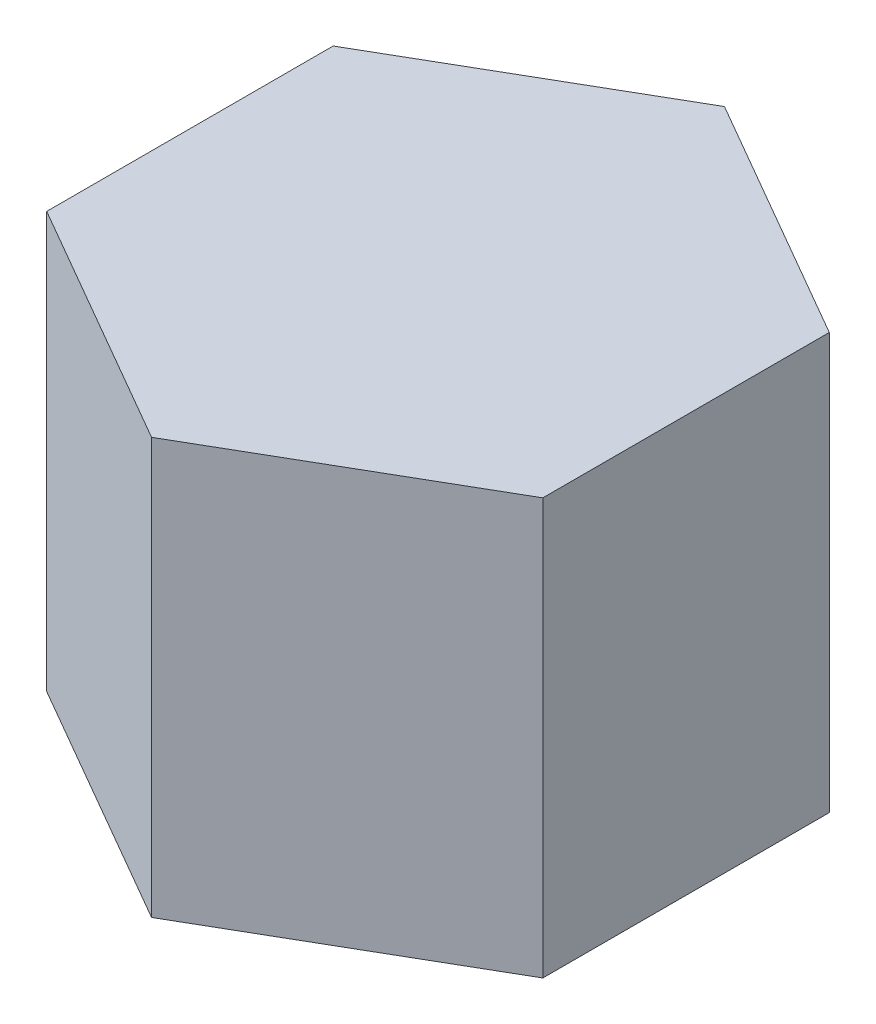
ISO-10303-21;
HEADER;
FILE_DESCRIPTION(('STEP AP214'),'2;1');
FILE_NAME('part.step','',(''),(''),'','','');
FILE_SCHEMA(('AUTOMOTIVE_DESIGN { 1 0 10303 214 1 1 1 1 }'));
ENDSEC;
DATA;
#1=APPLICATION_CONTEXT('core data for automotive mechanical design processes');
#2=APPLICATION_PROTOCOL_DEFINITION('international standard','automotive_design',2000,#1);
#3=PRODUCT_CONTEXT('',#1,'mechanical');
#4=PRODUCT('Part','Part','',(#3));
#5=PRODUCT_RELATED_PRODUCT_CATEGORY('part','',(#4));
#6=PRODUCT_DEFINITION_FORMATION('','',#4);
#7=PRODUCT_DEFINITION_CONTEXT('part definition',#1,'design');
#8=PRODUCT_DEFINITION('design','',#6,#7);
#9=PRODUCT_DEFINITION_SHAPE('','',#8);
#10=(LENGTH_UNIT() NAMED_UNIT(*) SI_UNIT(.MILLI.,.METRE.));
#11=(NAMED_UNIT(*) PLANE_ANGLE_UNIT() SI_UNIT($,.RADIAN.));
#12=(NAMED_UNIT(*) SI_UNIT($,.STERADIAN.) SOLID_ANGLE_UNIT());
#13=UNCERTAINTY_MEASURE_WITH_UNIT(LENGTH_MEASURE(1.E-05),#10,'distance_accuracy_value','');
#14=(GEOMETRIC_REPRESENTATION_CONTEXT(3) GLOBAL_UNCERTAINTY_ASSIGNED_CONTEXT((#13)) GLOBAL_UNIT_ASSIGNED_CONTEXT((#10,
#11,#12)) REPRESENTATION_CONTEXT('',''));
#15=CARTESIAN_POINT('',(0.,0.,0.));
#16=DIRECTION('',(0.,0.,1.));
#17=DIRECTION('',(1.,0.,0.));
#18=AXIS2_PLACEMENT_3D('',#15,#16,#17);
#19=CARTESIAN_POINT('',(207.142660308706,-148.537700895744,292.372996624279));
#20=DIRECTION('',(-0.499999999999909,0.,-0.866025403784491));
#21=DIRECTION('',(-0.866025403784491,0.,0.499999999999909));
#22=AXIS2_PLACEMENT_3D('',#19,#20,#21);
#23=PLANE('',#22);
#24=CARTESIAN_POINT('',(206.839551417382,-149.045793579175,292.547996624279));
#25=DIRECTION('',(0.866025403784491,0.,-0.499999999999909));
#26=VECTOR('',#25,1.);
#27=LINE('',#24,#26);
#28=CARTESIAN_POINT('',(206.839551417382,-149.045793579175,292.547996624279));
#29=VERTEX_POINT('',#28);
#30=CARTESIAN_POINT('',(207.142660308706,-149.045793579175,292.372996624279));
#31=VERTEX_POINT('',#30);
#32=EDGE_CURVE('E170',#29,#31,#27,.T.);
#33=ORIENTED_EDGE('',*,*,#32,.T.);
#34=CARTESIAN_POINT('',(207.142660308706,-148.537700895744,292.372996624279));
#35=DIRECTION('',(0.,-1.,0.));
#36=VECTOR('',#35,1.);
#37=LINE('',#34,#36);
#38=CARTESIAN_POINT('',(207.142660308706,-148.537700895744,292.372996624279));
#39=VERTEX_POINT('',#38);
#40=EDGE_CURVE('E35',#39,#31,#37,.T.);
#41=ORIENTED_EDGE('',*,*,#40,.F.);
#42=CARTESIAN_POINT('',(206.839551417382,-148.537700895744,292.547996624279));
#43=DIRECTION('',(0.866025403784491,0.,-0.499999999999909));
#44=VECTOR('',#43,1.);
#45=LINE('',#42,#44);
#46=CARTESIAN_POINT('',(206.839551417382,-148.537700895744,292.547996624279));
#47=VERTEX_POINT('',#46);
#48=EDGE_CURVE('E159',#47,#39,#45,.T.);
#49=ORIENTED_EDGE('',*,*,#48,.F.);
#50=CARTESIAN_POINT('',(206.839551417382,-148.537700895744,292.547996624279));
#51=DIRECTION('',(0.,-1.,0.));
#52=VECTOR('',#51,1.);
#53=LINE('',#50,#52);
#54=EDGE_CURVE('E10',#47,#29,#53,.T.);
#55=ORIENTED_EDGE('',*,*,#54,.T.);
#56=EDGE_LOOP('',(#33,#41,#49,#55));
#57=FACE_BOUND('',#56,.T.);
#58=ADVANCED_FACE('F16',(#57),#23,.F.);
#59=CARTESIAN_POINT('',(206.839551417382,-148.537700895744,292.547996624279));
#60=DIRECTION('',(0.500000000000062,0.,-0.866025403784403));
#61=DIRECTION('',(-0.866025403784403,0.,-0.500000000000062));
#62=AXIS2_PLACEMENT_3D('',#59,#60,#61);
#63=PLANE('',#62);
#64=CARTESIAN_POINT('',(206.536442526057,-149.045793579175,292.372996624279));
#65=DIRECTION('',(0.866025403784403,0.,0.500000000000062));
#66=VECTOR('',#65,1.);
#67=LINE('',#64,#66);
#68=CARTESIAN_POINT('',(206.536442526057,-149.045793579175,292.372996624279));
#69=VERTEX_POINT('',#68);
#70=EDGE_CURVE('E167',#69,#29,#67,.T.);
#71=ORIENTED_EDGE('',*,*,#70,.T.);
#72=ORIENTED_EDGE('',*,*,#54,.F.);
#73=CARTESIAN_POINT('',(206.536442526057,-148.537700895744,292.372996624279));
#74=DIRECTION('',(0.866025403784403,0.,0.500000000000062));
#75=VECTOR('',#74,1.);
#76=LINE('',#73,#75);
#77=CARTESIAN_POINT('',(206.536442526057,-148.537700895744,292.372996624279));
#78=VERTEX_POINT('',#77);
#79=EDGE_CURVE('E156',#78,#47,#76,.T.);
#80=ORIENTED_EDGE('',*,*,#79,.F.);
#81=CARTESIAN_POINT('',(206.536442526057,-148.537700895744,292.372996624279));
#82=DIRECTION('',(0.,-1.,0.));
#83=VECTOR('',#82,1.);
#84=LINE('',#81,#83);
#85=EDGE_CURVE('E27',#78,#69,#84,.T.);
#86=ORIENTED_EDGE('',*,*,#85,.T.);
#87=EDGE_LOOP('',(#71,#72,#80,#86));
#88=FACE_BOUND('',#87,.T.);
#89=ADVANCED_FACE('F189',(#88),#63,.F.);
#90=CARTESIAN_POINT('',(206.536442526057,-148.537700895744,290.831971220494));
#91=DIRECTION('',(1.,0.,0.));
#92=DIRECTION('',(0.,1.,0.));
#93=AXIS2_PLACEMENT_3D('',#90,#91,#92);
#94=PLANE('',#93);
#95=CARTESIAN_POINT('',(206.536442526057,-149.045793579175,292.022996624279));
#96=DIRECTION('',(0.,0.,1.));
#97=VECTOR('',#96,1.);
#98=LINE('',#95,#97);
#99=CARTESIAN_POINT('',(206.536442526057,-149.045793579175,292.022996624279));
#100=VERTEX_POINT('',#99);
#101=EDGE_CURVE('E163',#100,#69,#98,.T.);
#102=ORIENTED_EDGE('',*,*,#101,.T.);
#103=ORIENTED_EDGE('',*,*,#85,.F.);
#104=CARTESIAN_POINT('',(206.536442526057,-148.537700895744,292.022996624279));
#105=DIRECTION('',(0.,0.,1.));
#106=VECTOR('',#105,1.);
#107=LINE('',#104,#106);
#108=CARTESIAN_POINT('',(206.536442526057,-148.537700895744,292.022996624279));
#109=VERTEX_POINT('',#108);
#110=EDGE_CURVE('E106',#109,#78,#107,.T.);
#111=ORIENTED_EDGE('',*,*,#110,.F.);
#112=CARTESIAN_POINT('',(206.536442526057,-148.537700895744,292.022996624279));
#113=DIRECTION('',(0.,-1.,0.));
#114=VECTOR('',#113,1.);
#115=LINE('',#112,#114);
#116=EDGE_CURVE('E94',#109,#100,#115,.T.);
#117=ORIENTED_EDGE('',*,*,#116,.T.);
#118=EDGE_LOOP('',(#102,#103,#111,#117));
#119=FACE_BOUND('',#118,.T.);
#120=ADVANCED_FACE('F198',(#119),#94,.F.);
#121=CARTESIAN_POINT('',(206.536442526057,-148.537700895744,292.022996624279));
#122=DIRECTION('',(0.499999999999943,0.,0.866025403784472));
#123=DIRECTION('',(0.866025403784472,0.,-0.499999999999943));
#124=AXIS2_PLACEMENT_3D('',#121,#122,#123);
#125=PLANE('',#124);
#126=CARTESIAN_POINT('',(206.839551417382,-149.045793579175,291.847996624279));
#127=DIRECTION('',(-0.866025403784471,0.,0.499999999999943));
#128=VECTOR('',#127,1.);
#129=LINE('',#126,#128);
#130=CARTESIAN_POINT('',(206.839551417382,-149.045793579175,291.847996624279));
#131=VERTEX_POINT('',#130);
#132=EDGE_CURVE('E162',#131,#100,#129,.T.);
#133=ORIENTED_EDGE('',*,*,#132,.T.);
#134=ORIENTED_EDGE('',*,*,#116,.F.);
#135=CARTESIAN_POINT('',(206.839551417382,-148.537700895744,291.847996624279));
#136=DIRECTION('',(-0.866025403784471,0.,0.499999999999943));
#137=VECTOR('',#136,1.);
#138=LINE('',#135,#137);
#139=CARTESIAN_POINT('',(206.839551417382,-148.537700895744,291.847996624279));
#140=VERTEX_POINT('',#139);
#141=EDGE_CURVE('E98',#140,#109,#138,.T.);
#142=ORIENTED_EDGE('',*,*,#141,.F.);
#143=CARTESIAN_POINT('',(206.839551417382,-148.537700895744,291.847996624279));
#144=DIRECTION('',(0.,-1.,0.));
#145=VECTOR('',#144,1.);
#146=LINE('',#143,#145);
#147=EDGE_CURVE('E79',#140,#131,#146,.T.);
#148=ORIENTED_EDGE('',*,*,#147,.T.);
#149=EDGE_LOOP('',(#133,#134,#142,#148));
#150=FACE_BOUND('',#149,.T.);
#151=ADVANCED_FACE('F100',(#150),#125,.F.);
#152=CARTESIAN_POINT('',(206.839551417382,-148.537700895744,291.847996624279));
#153=DIRECTION('',(-0.500000000000062,0.,0.866025403784403));
#154=DIRECTION('',(0.866025403784403,0.,0.500000000000062));
#155=AXIS2_PLACEMENT_3D('',#152,#153,#154);
#156=PLANE('',#155);
#157=CARTESIAN_POINT('',(207.142660308706,-149.045793579175,292.022996624279));
#158=DIRECTION('',(-0.866025403784403,0.,-0.500000000000062));
#159=VECTOR('',#158,1.);
#160=LINE('',#157,#159);
#161=CARTESIAN_POINT('',(207.142660308706,-149.045793579175,292.022996624279));
#162=VERTEX_POINT('',#161);
#163=EDGE_CURVE('E88',#162,#131,#160,.T.);
#164=ORIENTED_EDGE('',*,*,#163,.T.);
#165=ORIENTED_EDGE('',*,*,#147,.F.);
#166=CARTESIAN_POINT('',(207.142660308706,-148.537700895744,292.022996624279));
#167=DIRECTION('',(-0.866025403784403,0.,-0.500000000000062));
#168=VECTOR('',#167,1.);
#169=LINE('',#166,#168);
#170=CARTESIAN_POINT('',(207.142660308706,-148.537700895744,292.022996624279));
#171=VERTEX_POINT('',#170);
#172=EDGE_CURVE('E84',#171,#140,#169,.T.);
#173=ORIENTED_EDGE('',*,*,#172,.F.);
#174=CARTESIAN_POINT('',(207.142660308706,-148.537700895744,292.022996624279));
#175=DIRECTION('',(0.,-1.,0.));
#176=VECTOR('',#175,1.);
#177=LINE('',#174,#176);
#178=EDGE_CURVE('E58',#171,#162,#177,.T.);
#179=ORIENTED_EDGE('',*,*,#178,.T.);
#180=EDGE_LOOP('',(#164,#165,#173,#179));
#181=FACE_BOUND('',#180,.T.);
#182=ADVANCED_FACE('F82',(#181),#156,.F.);
#183=CARTESIAN_POINT('',(207.142660308706,-148.537700895744,290.831971220494));
#184=DIRECTION('',(-1.,0.,0.));
#185=DIRECTION('',(0.,-1.,0.));
#186=AXIS2_PLACEMENT_3D('',#183,#184,#185);
#187=PLANE('',#186);
#188=CARTESIAN_POINT('',(207.142660308706,-149.045793579175,292.372996624279));
#189=DIRECTION('',(0.,0.,-1.));
#190=VECTOR('',#189,1.);
#191=LINE('',#188,#190);
#192=EDGE_CURVE('E160',#31,#162,#191,.T.);
#193=ORIENTED_EDGE('',*,*,#192,.T.);
#194=ORIENTED_EDGE('',*,*,#178,.F.);
#195=CARTESIAN_POINT('',(207.142660308706,-148.537700895744,292.372996624279));
#196=DIRECTION('',(0.,0.,-1.));
#197=VECTOR('',#196,1.);
#198=LINE('',#195,#197);
#199=EDGE_CURVE('E112',#39,#171,#198,.T.);
#200=ORIENTED_EDGE('',*,*,#199,.F.);
#201=ORIENTED_EDGE('',*,*,#40,.T.);
#202=EDGE_LOOP('',(#193,#194,#200,#201));
#203=FACE_BOUND('',#202,.T.);
#204=ADVANCED_FACE('F131',(#203),#187,.F.);
#205=CARTESIAN_POINT('',(206.339551417382,-148.537700895744,290.831971220494));
#206=DIRECTION('',(0.,-1.,0.));
#207=DIRECTION('',(1.,0.,0.));
#208=AXIS2_PLACEMENT_3D('',#205,#206,#207);
#209=PLANE('',#208);
#210=ORIENTED_EDGE('',*,*,#48,.T.);
#211=ORIENTED_EDGE('',*,*,#199,.T.);
#212=ORIENTED_EDGE('',*,*,#172,.T.);
#213=ORIENTED_EDGE('',*,*,#141,.T.);
#214=ORIENTED_EDGE('',*,*,#110,.T.);
#215=ORIENTED_EDGE('',*,*,#79,.T.);
#216=EDGE_LOOP('',(#210,#211,#212,#213,#214,#215));
#217=FACE_BOUND('',#216,.T.);
#218=ADVANCED_FACE('F111',(#217),#209,.F.);
#219=CARTESIAN_POINT('',(206.339551417382,-149.045793579175,290.831971220494));
#220=DIRECTION('',(0.,-1.,0.));
#221=DIRECTION('',(1.,0.,0.));
#222=AXIS2_PLACEMENT_3D('',#219,#220,#221);
#223=PLANE('',#222);
#224=ORIENTED_EDGE('',*,*,#32,.F.);
#225=ORIENTED_EDGE('',*,*,#70,.F.);
#226=ORIENTED_EDGE('',*,*,#101,.F.);
#227=ORIENTED_EDGE('',*,*,#132,.F.);
#228=ORIENTED_EDGE('',*,*,#163,.F.);
#229=ORIENTED_EDGE('',*,*,#192,.F.);
#230=EDGE_LOOP('',(#224,#225,#226,#227,#228,#229));
#231=FACE_BOUND('',#230,.T.);
#232=ADVANCED_FACE('F130',(#231),#223,.T.);
#233=CLOSED_SHELL('',(#58,#89,#120,#151,#182,#204,#218,#232));
#234=MANIFOLD_SOLID_BREP('B1',#233);
#235=ADVANCED_BREP_SHAPE_REPRESENTATION('',(#18,#234),#14);
#236=SHAPE_DEFINITION_REPRESENTATION(#9,#235);
ENDSEC;
END-ISO-10303-21;
